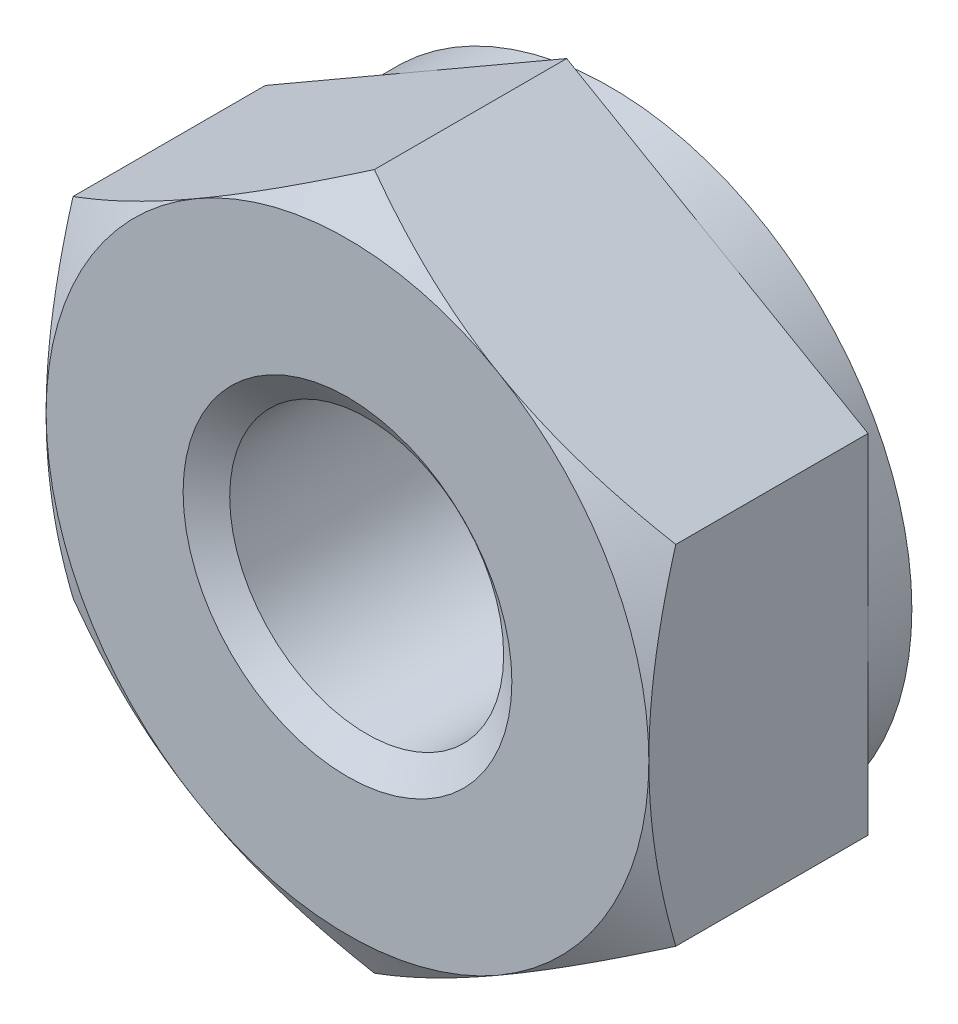
ISO-10303-21;
HEADER;
FILE_DESCRIPTION(('STEP AP214'),'2;1');
FILE_NAME('part.step','',(''),(''),'','','');
FILE_SCHEMA(('AUTOMOTIVE_DESIGN { 1 0 10303 214 1 1 1 1 }'));
ENDSEC;
DATA;
#1=APPLICATION_CONTEXT('core data for automotive mechanical design processes');
#2=APPLICATION_PROTOCOL_DEFINITION('international standard','automotive_design',2000,#1);
#3=PRODUCT_CONTEXT('',#1,'mechanical');
#4=PRODUCT('Part','Part','',(#3));
#5=PRODUCT_RELATED_PRODUCT_CATEGORY('part','',(#4));
#6=PRODUCT_DEFINITION_FORMATION('','',#4);
#7=PRODUCT_DEFINITION_CONTEXT('part definition',#1,'design');
#8=PRODUCT_DEFINITION('design','',#6,#7);
#9=PRODUCT_DEFINITION_SHAPE('','',#8);
#10=(LENGTH_UNIT() NAMED_UNIT(*) SI_UNIT(.MILLI.,.METRE.));
#11=(NAMED_UNIT(*) PLANE_ANGLE_UNIT() SI_UNIT($,.RADIAN.));
#12=(NAMED_UNIT(*) SI_UNIT($,.STERADIAN.) SOLID_ANGLE_UNIT());
#13=UNCERTAINTY_MEASURE_WITH_UNIT(LENGTH_MEASURE(1.E-05),#10,'distance_accuracy_value','');
#14=(GEOMETRIC_REPRESENTATION_CONTEXT(3) GLOBAL_UNCERTAINTY_ASSIGNED_CONTEXT((#13)) GLOBAL_UNIT_ASSIGNED_CONTEXT((#10,
#11,#12)) REPRESENTATION_CONTEXT('',''));
#15=CARTESIAN_POINT('',(0.,0.,0.));
#16=DIRECTION('',(0.,0.,1.));
#17=DIRECTION('',(1.,0.,0.));
#18=AXIS2_PLACEMENT_3D('',#15,#16,#17);
#19=CARTESIAN_POINT('',(0.,0.,-2.4));
#20=DIRECTION('',(0.,0.,1.));
#21=DIRECTION('',(1.,0.,0.));
#22=AXIS2_PLACEMENT_3D('',#19,#20,#21);
#23=CYLINDRICAL_SURFACE('',#22,1.25);
#24=CARTESIAN_POINT('',(0.,0.,-0.175051884552426));
#25=DIRECTION('',(0.,0.,1.));
#26=DIRECTION('',(1.,0.,0.));
#27=AXIS2_PLACEMENT_3D('',#24,#25,#26);
#28=CIRCLE('',#27,1.25);
#29=CARTESIAN_POINT('',(1.25,0.,-0.175051884552426));
#30=VERTEX_POINT('',#29);
#31=EDGE_CURVE('E153',#30,#30,#28,.F.);
#32=ORIENTED_EDGE('',*,*,#31,.F.);
#33=EDGE_LOOP('',(#32));
#34=FACE_BOUND('',#33,.T.);
#35=CARTESIAN_POINT('',(0.,0.,-2.19954811544757));
#36=DIRECTION('',(0.,0.,-1.));
#37=DIRECTION('',(-1.,0.,0.));
#38=AXIS2_PLACEMENT_3D('',#35,#36,#37);
#39=CIRCLE('',#38,1.25);
#40=CARTESIAN_POINT('',(-1.25,0.,-2.19954811544757));
#41=VERTEX_POINT('',#40);
#42=EDGE_CURVE('E41',#41,#41,#39,.F.);
#43=ORIENTED_EDGE('',*,*,#42,.F.);
#44=EDGE_LOOP('',(#43));
#45=FACE_BOUND('',#44,.T.);
#46=ADVANCED_FACE('F36',(#34,#45),#23,.F.);
#47=CARTESIAN_POINT('',(0.,3.17542648054295,-2.4));
#48=DIRECTION('',(0.,0.,-1.));
#49=DIRECTION('',(-1.,0.,0.));
#50=AXIS2_PLACEMENT_3D('',#47,#48,#49);
#51=PLANE('',#50);
#52=CARTESIAN_POINT('',(0.,0.,-2.4));
#53=DIRECTION('',(0.,0.,-1.));
#54=DIRECTION('',(-1.,0.,0.));
#55=AXIS2_PLACEMENT_3D('',#52,#53,#54);
#56=CIRCLE('',#55,2.75);
#57=CARTESIAN_POINT('',(-2.75,0.,-2.4));
#58=VERTEX_POINT('',#57);
#59=EDGE_CURVE('E280',#58,#58,#56,.F.);
#60=ORIENTED_EDGE('',*,*,#59,.F.);
#61=EDGE_LOOP('',(#60));
#62=FACE_BOUND('',#61,.T.);
#63=CARTESIAN_POINT('',(0.,0.,-2.4));
#64=DIRECTION('',(0.,0.,-1.));
#65=DIRECTION('',(-1.,0.,0.));
#66=AXIS2_PLACEMENT_3D('',#63,#64,#65);
#67=CIRCLE('',#66,1.5);
#68=CARTESIAN_POINT('',(-1.5,0.,-2.4));
#69=VERTEX_POINT('',#68);
#70=EDGE_CURVE('E300',#69,#69,#67,.F.);
#71=ORIENTED_EDGE('',*,*,#70,.T.);
#72=EDGE_LOOP('',(#71));
#73=FACE_BOUND('',#72,.T.);
#74=ADVANCED_FACE('F232',(#62,#73),#51,.T.);
#75=CARTESIAN_POINT('',(0.,3.17542648054295,0.));
#76=DIRECTION('',(0.,0.,-1.));
#77=DIRECTION('',(-1.,0.,0.));
#78=AXIS2_PLACEMENT_3D('',#75,#76,#77);
#79=PLANE('',#78);
#80=CARTESIAN_POINT('',(0.,0.,0.));
#81=DIRECTION('',(0.,0.,-1.));
#82=DIRECTION('',(-1.,0.,0.));
#83=AXIS2_PLACEMENT_3D('',#80,#81,#82);
#84=CIRCLE('',#83,2.75);
#85=CARTESIAN_POINT('',(-1.375,2.3815698604072,0.));
#86=VERTEX_POINT('',#85);
#87=CARTESIAN_POINT('',(-2.75,0.,0.));
#88=VERTEX_POINT('',#87);
#89=EDGE_CURVE('E48',#86,#88,#84,.F.);
#90=ORIENTED_EDGE('',*,*,#89,.T.);
#91=CARTESIAN_POINT('',(-1.375,-2.3815698604072,0.));
#92=VERTEX_POINT('',#91);
#93=EDGE_CURVE('E12',#88,#92,#84,.F.);
#94=ORIENTED_EDGE('',*,*,#93,.T.);
#95=CARTESIAN_POINT('',(1.375,-2.3815698604072,0.));
#96=VERTEX_POINT('',#95);
#97=EDGE_CURVE('E46',#92,#96,#84,.F.);
#98=ORIENTED_EDGE('',*,*,#97,.T.);
#99=CARTESIAN_POINT('',(2.75,0.,0.));
#100=VERTEX_POINT('',#99);
#101=EDGE_CURVE('E132',#96,#100,#84,.F.);
#102=ORIENTED_EDGE('',*,*,#101,.T.);
#103=CARTESIAN_POINT('',(0.,0.,0.));
#104=DIRECTION('',(0.,0.,1.));
#105=DIRECTION('',(1.,0.,0.));
#106=AXIS2_PLACEMENT_3D('',#103,#104,#105);
#107=CIRCLE('',#106,2.75);
#108=CARTESIAN_POINT('',(1.375,2.3815698604072,0.));
#109=VERTEX_POINT('',#108);
#110=EDGE_CURVE('E144',#100,#109,#107,.T.);
#111=ORIENTED_EDGE('',*,*,#110,.T.);
#112=EDGE_CURVE('E159',#109,#86,#84,.F.);
#113=ORIENTED_EDGE('',*,*,#112,.T.);
#114=EDGE_LOOP('',(#90,#94,#98,#102,#111,#113));
#115=FACE_BOUND('',#114,.T.);
#116=CARTESIAN_POINT('',(0.,0.,0.));
#117=DIRECTION('',(0.,0.,1.));
#118=DIRECTION('',(1.,0.,0.));
#119=AXIS2_PLACEMENT_3D('',#116,#117,#118);
#120=CIRCLE('',#119,1.5);
#121=CARTESIAN_POINT('',(1.5,0.,0.));
#122=VERTEX_POINT('',#121);
#123=EDGE_CURVE('E299',#122,#122,#120,.T.);
#124=ORIENTED_EDGE('',*,*,#123,.F.);
#125=EDGE_LOOP('',(#124));
#126=FACE_BOUND('',#125,.T.);
#127=ADVANCED_FACE('F156',(#115,#126),#79,.F.);
#128=CARTESIAN_POINT('',(0.,3.17542648054294,-2.4));
#129=DIRECTION('',(-0.500000000000001,0.866025403784438,0.));
#130=DIRECTION('',(-0.866025403784438,-0.500000000000001,0.));
#131=AXIS2_PLACEMENT_3D('',#128,#129,#130);
#132=PLANE('',#131);
#133=DIRECTION('',(0.,0.,1.));
#134=VECTOR('',#133,1.);
#135=CARTESIAN_POINT('',(-2.75,1.58771324027147,-2.4));
#136=LINE('',#135,#134);
#137=CARTESIAN_POINT('',(-2.75,1.58771324027147,-2.));
#138=VERTEX_POINT('',#137);
#139=CARTESIAN_POINT('',(-2.75,1.58771324027147,-0.245620093061865));
#140=VERTEX_POINT('',#139);
#141=EDGE_CURVE('E289',#138,#140,#136,.T.);
#142=ORIENTED_EDGE('',*,*,#141,.T.);
#143=CARTESIAN_POINT('',(-2.7502,1.58759777021763,-0.24568676336476));
#144=CARTESIAN_POINT('',(-2.62935077934009,1.65737010029698,-0.205387662249263));
#145=CARTESIAN_POINT('',(-2.50745839737737,1.72774469983533,-0.168736902597662));
#146=CARTESIAN_POINT('',(-2.26156287327211,1.86971254687003,-0.104762182969801));
#147=CARTESIAN_POINT('',(-2.13755536142614,1.94130831721583,-0.077460855674497));
#148=CARTESIAN_POINT('',(-1.89107720202406,2.08361254889599,-0.0349617452941163));
#149=CARTESIAN_POINT('',(-1.76864448141258,2.15429911309864,-0.0194811186224572));
#150=CARTESIAN_POINT('',(-1.52320285763108,2.29600490065923,-0.000999397369940011));
#151=CARTESIAN_POINT('',(-1.40019484676709,2.36702360884404,0.00201700053740051));
#152=CARTESIAN_POINT('',(-1.17034121338921,2.49972966594897,-0.00425314542854678));
#153=CARTESIAN_POINT('',(-1.06346120874598,2.56143686540073,-0.0120001542767026));
#154=CARTESIAN_POINT('',(-0.850397532665251,2.68444923614047,-0.0365551810643552));
#155=CARTESIAN_POINT('',(-0.744214598351111,2.74575398185008,-0.0533715896505709));
#156=CARTESIAN_POINT('',(-0.530711510606816,2.86902004703207,-0.0954119223459575));
#157=CARTESIAN_POINT('',(-0.423418383857145,2.93096576264319,-0.120814080687232));
#158=CARTESIAN_POINT('',(-0.210432520715949,3.05393320806134,-0.178467225839984));
#159=CARTESIAN_POINT('',(-0.104737054973348,3.11495651365995,-0.210704663298985));
#160=CARTESIAN_POINT('',(0.000199999999999952,3.17554195059678,-0.245686763364763));
#161=B_SPLINE_CURVE_WITH_KNOTS('',3,(#143,#144,#145,#146,#147,#148,#149,#150,#151,#152,#153,
#154,#155,#156,#157,#158,#159,#160),.UNSPECIFIED.,.F.,.F.,(4,2,2,2,2,2,2,2,4),(0.,
0.435912828725889,0.872873557116333,1.29901931904672,1.72464171213574,2.09526089052938,
2.46622354066375,2.84541551798557,3.22386274754525),.UNSPECIFIED.);
#162=EDGE_CURVE('E60',#140,#86,#161,.T.);
#163=ORIENTED_EDGE('',*,*,#162,.T.);
#164=CARTESIAN_POINT('',(0.,3.17542648054295,-0.245620093061865));
#165=VERTEX_POINT('',#164);
#166=EDGE_CURVE('E168',#86,#165,#161,.T.);
#167=ORIENTED_EDGE('',*,*,#166,.T.);
#168=DIRECTION('',(0.,0.,1.));
#169=VECTOR('',#168,1.);
#170=CARTESIAN_POINT('',(0.,3.17542648054294,-2.4));
#171=LINE('',#170,#169);
#172=CARTESIAN_POINT('',(0.,3.17542648054294,-2.));
#173=VERTEX_POINT('',#172);
#174=EDGE_CURVE('E277',#173,#165,#171,.T.);
#175=ORIENTED_EDGE('',*,*,#174,.F.);
#176=DIRECTION('',(-0.866025403784438,-0.500000000000001,0.));
#177=VECTOR('',#176,1.);
#178=CARTESIAN_POINT('',(0.,3.17542648054294,-2.));
#179=LINE('',#178,#177);
#180=CARTESIAN_POINT('',(-1.375,2.38156986040721,-2.));
#181=VERTEX_POINT('',#180);
#182=EDGE_CURVE('E265',#173,#181,#179,.T.);
#183=ORIENTED_EDGE('',*,*,#182,.T.);
#184=EDGE_CURVE('E261',#181,#138,#179,.T.);
#185=ORIENTED_EDGE('',*,*,#184,.T.);
#186=EDGE_LOOP('',(#142,#163,#167,#175,#183,#185));
#187=FACE_BOUND('',#186,.T.);
#188=ADVANCED_FACE('F38',(#187),#132,.T.);
#189=CARTESIAN_POINT('',(2.75,1.58771324027147,-2.4));
#190=DIRECTION('',(0.500000000000001,0.866025403784438,0.));
#191=DIRECTION('',(-0.866025403784438,0.500000000000001,0.));
#192=AXIS2_PLACEMENT_3D('',#189,#190,#191);
#193=PLANE('',#192);
#194=ORIENTED_EDGE('',*,*,#174,.T.);
#195=CARTESIAN_POINT('',(-0.000199999999999979,3.17554195059678,-0.245686763364763));
#196=CARTESIAN_POINT('',(0.120649220659906,3.10576962051743,-0.205387662249265));
#197=CARTESIAN_POINT('',(0.242541602622634,3.03539502097908,-0.168736902597664));
#198=CARTESIAN_POINT('',(0.488437126727893,2.89342717394439,-0.104762182969802));
#199=CARTESIAN_POINT('',(0.612444638573856,2.82183140359859,-0.0774608556744985));
#200=CARTESIAN_POINT('',(0.858922797975944,2.67952717191843,-0.0349617452941174));
#201=CARTESIAN_POINT('',(0.981355518587418,2.60884060771577,-0.019481118622458));
#202=CARTESIAN_POINT('',(1.22679714236892,2.46713482015518,-0.000999397369940287));
#203=CARTESIAN_POINT('',(1.34980515323291,2.39611611197038,0.00201700053740053));
#204=CARTESIAN_POINT('',(1.57965878661079,2.26341005486544,-0.00425314542854643));
#205=CARTESIAN_POINT('',(1.68653879125402,2.20170285541369,-0.0120001542767021));
#206=CARTESIAN_POINT('',(1.89960246733475,2.07869048467395,-0.0365551810643545));
#207=CARTESIAN_POINT('',(2.00578540164889,2.01738573896433,-0.0533715896505701));
#208=CARTESIAN_POINT('',(2.21928848939318,1.89411967378235,-0.095411922345956));
#209=CARTESIAN_POINT('',(2.32658161614286,1.83217395817123,-0.12081408068723));
#210=CARTESIAN_POINT('',(2.53956747928405,1.70920651275307,-0.178467225839982));
#211=CARTESIAN_POINT('',(2.64526294502665,1.64818320715446,-0.210704663298982));
#212=CARTESIAN_POINT('',(2.7502,1.58759777021763,-0.24568676336476));
#213=B_SPLINE_CURVE_WITH_KNOTS('',3,(#195,#196,#197,#198,#199,#200,#201,#202,#203,#204,#205,
#206,#207,#208,#209,#210,#211,#212),.UNSPECIFIED.,.F.,.F.,(4,2,2,2,2,2,2,2,4),(0.,
0.435912828725889,0.872873557116334,1.29901931904672,1.72464171213574,2.09526089052938,
2.46622354066375,2.84541551798558,3.22386274754525),.UNSPECIFIED.);
#214=EDGE_CURVE('E165',#165,#109,#213,.T.);
#215=ORIENTED_EDGE('',*,*,#214,.T.);
#216=CARTESIAN_POINT('',(2.75,1.58771324027148,-0.245620093061865));
#217=VERTEX_POINT('',#216);
#218=EDGE_CURVE('E147',#109,#217,#213,.T.);
#219=ORIENTED_EDGE('',*,*,#218,.T.);
#220=DIRECTION('',(0.,0.,1.));
#221=VECTOR('',#220,1.);
#222=CARTESIAN_POINT('',(2.75,1.58771324027147,-2.4));
#223=LINE('',#222,#221);
#224=CARTESIAN_POINT('',(2.75,1.58771324027147,-2.));
#225=VERTEX_POINT('',#224);
#226=EDGE_CURVE('E164',#225,#217,#223,.T.);
#227=ORIENTED_EDGE('',*,*,#226,.F.);
#228=DIRECTION('',(-0.866025403784438,0.500000000000001,0.));
#229=VECTOR('',#228,1.);
#230=CARTESIAN_POINT('',(2.75,1.58771324027147,-2.));
#231=LINE('',#230,#229);
#232=CARTESIAN_POINT('',(1.375,2.38156986040721,-2.));
#233=VERTEX_POINT('',#232);
#234=EDGE_CURVE('E273',#225,#233,#231,.T.);
#235=ORIENTED_EDGE('',*,*,#234,.T.);
#236=EDGE_CURVE('E269',#233,#173,#231,.T.);
#237=ORIENTED_EDGE('',*,*,#236,.T.);
#238=EDGE_LOOP('',(#194,#215,#219,#227,#235,#237));
#239=FACE_BOUND('',#238,.T.);
#240=ADVANCED_FACE('F245',(#239),#193,.T.);
#241=CARTESIAN_POINT('',(2.75,1.58771324027147,-2.4));
#242=DIRECTION('',(-1.,0.,0.));
#243=DIRECTION('',(0.,0.,1.));
#244=AXIS2_PLACEMENT_3D('',#241,#242,#243);
#245=PLANE('',#244);
#246=CARTESIAN_POINT('',(2.75,-4.21084949309676,-1.31594843960294));
#247=CARTESIAN_POINT('',(2.75,-4.0901089421409,-1.25759993615224));
#248=CARTESIAN_POINT('',(2.75,-3.96908292065509,-1.19983146511759));
#249=CARTESIAN_POINT('',(2.75,-3.72630558284844,-1.08578603842305));
#250=CARTESIAN_POINT('',(2.75,-3.604554145362,-1.02950934100247));
#251=CARTESIAN_POINT('',(2.75,-3.35951393034355,-0.91848244335276));
#252=CARTESIAN_POINT('',(2.75,-3.23622034236437,-0.86374282160584));
#253=CARTESIAN_POINT('',(2.75,-2.98861980138744,-0.756614777476456));
#254=CARTESIAN_POINT('',(2.75,-2.86431290161182,-0.704226232536766));
#255=CARTESIAN_POINT('',(2.75,-2.61294485887172,-0.601803572146126));
#256=CARTESIAN_POINT('',(2.75,-2.48586863815655,-0.551806257898395));
#257=CARTESIAN_POINT('',(2.75,-2.23021732171541,-0.455727408784602));
#258=CARTESIAN_POINT('',(2.75,-2.10164206103363,-0.409646309576973));
#259=CARTESIAN_POINT('',(2.75,-1.84305218799467,-0.322638077046232));
#260=CARTESIAN_POINT('',(2.75,-1.71304130052584,-0.281699986413889));
#261=CARTESIAN_POINT('',(2.75,-1.45117125062148,-0.206307307624349));
#262=CARTESIAN_POINT('',(2.75,-1.31931268690202,-0.171850669152767));
#263=CARTESIAN_POINT('',(2.75,-1.05365722480013,-0.111093671530904));
#264=CARTESIAN_POINT('',(2.75,-0.919859820217593,-0.0847954840951217));
#265=CARTESIAN_POINT('',(2.75,-0.650651874037382,-0.0421260371966113));
#266=CARTESIAN_POINT('',(2.75,-0.515241331013596,-0.0257547865105431));
#267=CARTESIAN_POINT('',(2.75,-0.244373242869211,-0.00438749654023743));
#268=CARTESIAN_POINT('',(2.75,-0.108921526377133,0.00068055677321595));
#269=CARTESIAN_POINT('',(2.75,0.161887058855134,-0.000827795632671998));
#270=CARTESIAN_POINT('',(2.75,0.29724394308964,-0.00740117868555366));
#271=CARTESIAN_POINT('',(2.75,0.528385436717541,-0.0281041300468438));
#272=CARTESIAN_POINT('',(2.75,0.624425050137499,-0.0395376410301882));
#273=CARTESIAN_POINT('',(2.75,0.815762399811542,-0.0675217196133508));
#274=CARTESIAN_POINT('',(2.75,0.911060016631964,-0.0840730942276819));
#275=CARTESIAN_POINT('',(2.75,1.19576218748916,-0.140535361278284));
#276=CARTESIAN_POINT('',(2.75,1.38383224738496,-0.187239859417293));
#277=CARTESIAN_POINT('',(2.75,1.66525048947485,-0.267792497030578));
#278=CARTESIAN_POINT('',(2.75,1.76006556248558,-0.2968033349955));
#279=CARTESIAN_POINT('',(2.75,1.94870609382215,-0.357695648906587));
#280=CARTESIAN_POINT('',(2.75,2.04253218553696,-0.389575144878502));
#281=CARTESIAN_POINT('',(2.75,2.22880240354984,-0.455541418186447));
#282=CARTESIAN_POINT('',(2.75,2.32125133588451,-0.489614761455532));
#283=CARTESIAN_POINT('',(2.75,2.50543192042628,-0.559761368231108));
#284=CARTESIAN_POINT('',(2.75,2.59716326539578,-0.595835440037317));
#285=CARTESIAN_POINT('',(2.75,2.68856293053345,-0.632712441997483));
#286=B_SPLINE_CURVE_WITH_KNOTS('',3,(#246,#247,#248,#249,#250,#251,#252,#253,#254,#255,#256,
#257,#258,#259,#260,#261,#262,#263,#264,#265,#266,#267,#268,#269,#270,#271,#272,#273,#274,#275,
#276,#277,#278,#279,#280,#281,#282,#283,#284,#285),.UNSPECIFIED.,.F.,.F.,(4,2,2,2,2,2,2,2,2,2,2,
2,2,2,2,2,2,2,2,4),(0.,0.402305607365936,0.804680408536997,1.20935783819118,1.61401414820818,
2.0236383818577,2.43330812457349,2.842089694796,3.25074173456636,3.65950246109144,
4.06826354901184,4.4744128402465,4.88045669141172,5.17046846817546,5.46052599902452,
6.04107275309883,6.33851131304661,6.63574613017455,6.93130791005792,7.22698998004822),.UNSPECIFIED.);
#287=CARTESIAN_POINT('',(2.75,-1.58771324027147,-0.245620093061865));
#288=VERTEX_POINT('',#287);
#289=EDGE_CURVE('E128',#288,#100,#286,.T.);
#290=ORIENTED_EDGE('',*,*,#289,.F.);
#291=DIRECTION('',(0.,0.,1.));
#292=VECTOR('',#291,1.);
#293=CARTESIAN_POINT('',(2.75,-1.58771324027148,-2.4));
#294=LINE('',#293,#292);
#295=CARTESIAN_POINT('',(2.75,-1.58771324027148,-2.));
#296=VERTEX_POINT('',#295);
#297=EDGE_CURVE('E282',#296,#288,#294,.T.);
#298=ORIENTED_EDGE('',*,*,#297,.F.);
#299=DIRECTION('',(0.,-1.,0.));
#300=VECTOR('',#299,1.);
#301=CARTESIAN_POINT('',(2.75,1.58771324027147,-2.));
#302=LINE('',#301,#300);
#303=CARTESIAN_POINT('',(2.75,0.,-2.));
#304=VERTEX_POINT('',#303);
#305=EDGE_CURVE('E274',#304,#296,#302,.T.);
#306=ORIENTED_EDGE('',*,*,#305,.F.);
#307=EDGE_CURVE('E276',#225,#304,#302,.T.);
#308=ORIENTED_EDGE('',*,*,#307,.F.);
#309=ORIENTED_EDGE('',*,*,#226,.T.);
#310=EDGE_CURVE('E141',#100,#217,#286,.T.);
#311=ORIENTED_EDGE('',*,*,#310,.F.);
#312=EDGE_LOOP('',(#290,#298,#306,#308,#309,#311));
#313=FACE_BOUND('',#312,.T.);
#314=ADVANCED_FACE('F161',(#313),#245,.F.);
#315=CARTESIAN_POINT('',(0.,-3.17542648054295,-2.4));
#316=DIRECTION('',(0.500000000000001,-0.866025403784438,0.));
#317=DIRECTION('',(0.866025403784438,0.500000000000001,0.));
#318=AXIS2_PLACEMENT_3D('',#315,#316,#317);
#319=PLANE('',#318);
#320=ORIENTED_EDGE('',*,*,#297,.T.);
#321=CARTESIAN_POINT('',(2.7502,-1.58759777021764,-0.245686763364762));
#322=CARTESIAN_POINT('',(2.62935077934009,-1.65737010029699,-0.205387662249265));
#323=CARTESIAN_POINT('',(2.50745839737737,-1.72774469983534,-0.168736902597664));
#324=CARTESIAN_POINT('',(2.26156287327211,-1.86971254687003,-0.104762182969803));
#325=CARTESIAN_POINT('',(2.13755536142614,-1.94130831721583,-0.0774608556744994));
#326=CARTESIAN_POINT('',(1.89107720202406,-2.08361254889599,-0.0349617452941191));
#327=CARTESIAN_POINT('',(1.76864448141258,-2.15429911309865,-0.0194811186224602));
#328=CARTESIAN_POINT('',(1.52320285763108,-2.29600490065924,-0.000999397369943106));
#329=CARTESIAN_POINT('',(1.40019484676709,-2.36702360884404,0.00201700053739756));
#330=CARTESIAN_POINT('',(1.17034121338921,-2.49972966594898,-0.00425314542854994));
#331=CARTESIAN_POINT('',(1.06346120874598,-2.56143686540073,-0.012000154276706));
#332=CARTESIAN_POINT('',(0.850397532665249,-2.68444923614047,-0.036555181064359));
#333=CARTESIAN_POINT('',(0.74421459835111,-2.74575398185009,-0.0533715896505746));
#334=CARTESIAN_POINT('',(0.530711510606816,-2.86902004703207,-0.0954119223459611));
#335=CARTESIAN_POINT('',(0.423418383857144,-2.93096576264319,-0.120814080687236));
#336=CARTESIAN_POINT('',(0.210432520715949,-3.05393320806135,-0.178467225839987));
#337=CARTESIAN_POINT('',(0.104737054973347,-3.11495651365996,-0.210704663298988));
#338=CARTESIAN_POINT('',(-0.000200000000000004,-3.17554195059679,-0.245686763364766));
#339=B_SPLINE_CURVE_WITH_KNOTS('',3,(#321,#322,#323,#324,#325,#326,#327,#328,#329,#330,#331,
#332,#333,#334,#335,#336,#337,#338),.UNSPECIFIED.,.F.,.F.,(4,2,2,2,2,2,2,2,4),(0.,
0.435912828725889,0.872873557116334,1.29901931904672,1.72464171213574,2.09526089052938,
2.46622354066375,2.84541551798557,3.22386274754524),.UNSPECIFIED.);
#340=EDGE_CURVE('E135',#288,#96,#339,.T.);
#341=ORIENTED_EDGE('',*,*,#340,.T.);
#342=CARTESIAN_POINT('',(0.,-3.17542648054294,-0.245620093061865));
#343=VERTEX_POINT('',#342);
#344=EDGE_CURVE('E175',#96,#343,#339,.T.);
#345=ORIENTED_EDGE('',*,*,#344,.T.);
#346=DIRECTION('',(0.,0.,1.));
#347=VECTOR('',#346,1.);
#348=CARTESIAN_POINT('',(0.,-3.17542648054295,-2.4));
#349=LINE('',#348,#347);
#350=CARTESIAN_POINT('',(0.,-3.17542648054295,-2.));
#351=VERTEX_POINT('',#350);
#352=EDGE_CURVE('E284',#351,#343,#349,.T.);
#353=ORIENTED_EDGE('',*,*,#352,.F.);
#354=DIRECTION('',(0.866025403784438,0.500000000000001,0.));
#355=VECTOR('',#354,1.);
#356=CARTESIAN_POINT('',(0.,-3.17542648054295,-2.));
#357=LINE('',#356,#355);
#358=CARTESIAN_POINT('',(1.37500000000001,-2.38156986040721,-2.));
#359=VERTEX_POINT('',#358);
#360=EDGE_CURVE('E266',#351,#359,#357,.T.);
#361=ORIENTED_EDGE('',*,*,#360,.T.);
#362=EDGE_CURVE('E270',#359,#296,#357,.T.);
#363=ORIENTED_EDGE('',*,*,#362,.T.);
#364=EDGE_LOOP('',(#320,#341,#345,#353,#361,#363));
#365=FACE_BOUND('',#364,.T.);
#366=ADVANCED_FACE('F218',(#365),#319,.T.);
#367=CARTESIAN_POINT('',(-2.75,-1.58771324027148,-2.4));
#368=DIRECTION('',(-0.500000000000001,-0.866025403784438,0.));
#369=DIRECTION('',(0.866025403784438,-0.500000000000001,0.));
#370=AXIS2_PLACEMENT_3D('',#367,#368,#369);
#371=PLANE('',#370);
#372=ORIENTED_EDGE('',*,*,#352,.T.);
#373=CARTESIAN_POINT('',(0.000199999999999937,-3.17554195059679,-0.245686763364766));
#374=CARTESIAN_POINT('',(-0.120649220659906,-3.10576962051743,-0.205387662249269));
#375=CARTESIAN_POINT('',(-0.242541602622634,-3.03539502097909,-0.168736902597667));
#376=CARTESIAN_POINT('',(-0.488437126727894,-2.89342717394439,-0.104762182969805));
#377=CARTESIAN_POINT('',(-0.612444638573857,-2.82183140359859,-0.0774608556745013));
#378=CARTESIAN_POINT('',(-0.858922797975946,-2.67952717191843,-0.0349617452941203));
#379=CARTESIAN_POINT('',(-0.98135551858742,-2.60884060771578,-0.0194811186224612));
#380=CARTESIAN_POINT('',(-1.22679714236892,-2.46713482015519,-0.000999397369943545));
#381=CARTESIAN_POINT('',(-1.34980515323292,-2.39611611197038,0.00201700053739738));
#382=CARTESIAN_POINT('',(-1.5796587866108,-2.26341005486545,-0.00425314542854941));
#383=CARTESIAN_POINT('',(-1.68653879125402,-2.20170285541369,-0.012000154276705));
#384=CARTESIAN_POINT('',(-1.89960246733475,-2.07869048467395,-0.0365551810643573));
#385=CARTESIAN_POINT('',(-2.00578540164889,-2.01738573896434,-0.0533715896505729));
#386=CARTESIAN_POINT('',(-2.21928848939319,-1.89411967378235,-0.0954119223459589));
#387=CARTESIAN_POINT('',(-2.32658161614286,-1.83217395817123,-0.120814080687233));
#388=CARTESIAN_POINT('',(-2.53956747928405,-1.70920651275308,-0.178467225839984));
#389=CARTESIAN_POINT('',(-2.64526294502665,-1.64818320715447,-0.210704663298984));
#390=CARTESIAN_POINT('',(-2.7502,-1.58759777021764,-0.245686763364762));
#391=B_SPLINE_CURVE_WITH_KNOTS('',3,(#373,#374,#375,#376,#377,#378,#379,#380,#381,#382,#383,
#384,#385,#386,#387,#388,#389,#390),.UNSPECIFIED.,.F.,.F.,(4,2,2,2,2,2,2,2,4),(0.,
0.43591282872589,0.872873557116336,1.29901931904672,1.72464171213574,2.09526089052938,
2.46622354066375,2.84541551798557,3.22386274754525),.UNSPECIFIED.);
#392=EDGE_CURVE('E212',#343,#92,#391,.T.);
#393=ORIENTED_EDGE('',*,*,#392,.T.);
#394=CARTESIAN_POINT('',(-2.75,-1.58771324027148,-0.245620093061865));
#395=VERTEX_POINT('',#394);
#396=EDGE_CURVE('E205',#92,#395,#391,.T.);
#397=ORIENTED_EDGE('',*,*,#396,.T.);
#398=DIRECTION('',(0.,0.,1.));
#399=VECTOR('',#398,1.);
#400=CARTESIAN_POINT('',(-2.75,-1.58771324027148,-2.4));
#401=LINE('',#400,#399);
#402=CARTESIAN_POINT('',(-2.75,-1.58771324027148,-2.));
#403=VERTEX_POINT('',#402);
#404=EDGE_CURVE('E287',#403,#395,#401,.T.);
#405=ORIENTED_EDGE('',*,*,#404,.F.);
#406=DIRECTION('',(0.866025403784438,-0.500000000000001,0.));
#407=VECTOR('',#406,1.);
#408=CARTESIAN_POINT('',(-2.75,-1.58771324027148,-2.));
#409=LINE('',#408,#407);
#410=CARTESIAN_POINT('',(-1.37500000000001,-2.38156986040721,-2.));
#411=VERTEX_POINT('',#410);
#412=EDGE_CURVE('E256',#403,#411,#409,.T.);
#413=ORIENTED_EDGE('',*,*,#412,.T.);
#414=EDGE_CURVE('E262',#411,#351,#409,.T.);
#415=ORIENTED_EDGE('',*,*,#414,.T.);
#416=EDGE_LOOP('',(#372,#393,#397,#405,#413,#415));
#417=FACE_BOUND('',#416,.T.);
#418=ADVANCED_FACE('F214',(#417),#371,.T.);
#419=CARTESIAN_POINT('',(-2.75,1.58771324027147,-2.4));
#420=DIRECTION('',(-1.,0.,0.));
#421=DIRECTION('',(0.,0.,1.));
#422=AXIS2_PLACEMENT_3D('',#419,#420,#421);
#423=PLANE('',#422);
#424=ORIENTED_EDGE('',*,*,#404,.T.);
#425=CARTESIAN_POINT('',(-2.75,-4.21084949309676,-1.31594843960294));
#426=CARTESIAN_POINT('',(-2.75,-4.0901089421409,-1.25759993615224));
#427=CARTESIAN_POINT('',(-2.75,-3.96908292065509,-1.19983146511759));
#428=CARTESIAN_POINT('',(-2.75,-3.72630558284844,-1.08578603842305));
#429=CARTESIAN_POINT('',(-2.75,-3.604554145362,-1.02950934100247));
#430=CARTESIAN_POINT('',(-2.75,-3.35951393034355,-0.91848244335276));
#431=CARTESIAN_POINT('',(-2.75,-3.23622034236437,-0.86374282160584));
#432=CARTESIAN_POINT('',(-2.75,-2.98861980138744,-0.756614777476456));
#433=CARTESIAN_POINT('',(-2.75,-2.86431290161182,-0.704226232536766));
#434=CARTESIAN_POINT('',(-2.75,-2.61294485887172,-0.601803572146126));
#435=CARTESIAN_POINT('',(-2.75,-2.48586863815655,-0.551806257898395));
#436=CARTESIAN_POINT('',(-2.75,-2.23021732171541,-0.455727408784602));
#437=CARTESIAN_POINT('',(-2.75,-2.10164206103363,-0.409646309576973));
#438=CARTESIAN_POINT('',(-2.75,-1.84305218799467,-0.322638077046232));
#439=CARTESIAN_POINT('',(-2.75,-1.71304130052583,-0.281699986413889));
#440=CARTESIAN_POINT('',(-2.75,-1.45117125062148,-0.206307307624349));
#441=CARTESIAN_POINT('',(-2.75,-1.31931268690202,-0.171850669152767));
#442=CARTESIAN_POINT('',(-2.75,-1.05365722480013,-0.111093671530904));
#443=CARTESIAN_POINT('',(-2.75,-0.919859820217592,-0.0847954840951217));
#444=CARTESIAN_POINT('',(-2.75,-0.650651874037382,-0.0421260371966113));
#445=CARTESIAN_POINT('',(-2.75,-0.515241331013595,-0.0257547865105431));
#446=CARTESIAN_POINT('',(-2.75,-0.244373242869211,-0.00438749654023743));
#447=CARTESIAN_POINT('',(-2.75,-0.108921526377133,0.00068055677321595));
#448=CARTESIAN_POINT('',(-2.75,0.161887058855134,-0.000827795632671998));
#449=CARTESIAN_POINT('',(-2.75,0.29724394308964,-0.00740117868555365));
#450=CARTESIAN_POINT('',(-2.75,0.528385436717541,-0.0281041300468438));
#451=CARTESIAN_POINT('',(-2.75,0.624425050137499,-0.0395376410301882));
#452=CARTESIAN_POINT('',(-2.75,0.815762399811542,-0.0675217196133508));
#453=CARTESIAN_POINT('',(-2.75,0.911060016631964,-0.0840730942276819));
#454=CARTESIAN_POINT('',(-2.75,1.19576218748916,-0.140535361278284));
#455=CARTESIAN_POINT('',(-2.75,1.38383224738496,-0.187239859417293));
#456=CARTESIAN_POINT('',(-2.75,1.66525048947485,-0.267792497030578));
#457=CARTESIAN_POINT('',(-2.75,1.76006556248558,-0.2968033349955));
#458=CARTESIAN_POINT('',(-2.75,1.94870609382215,-0.357695648906587));
#459=CARTESIAN_POINT('',(-2.75,2.04253218553696,-0.389575144878503));
#460=CARTESIAN_POINT('',(-2.75,2.22880240354984,-0.455541418186448));
#461=CARTESIAN_POINT('',(-2.75,2.32125133588451,-0.489614761455532));
#462=CARTESIAN_POINT('',(-2.75,2.50543192042628,-0.559761368231108));
#463=CARTESIAN_POINT('',(-2.75,2.59716326539579,-0.595835440037317));
#464=CARTESIAN_POINT('',(-2.75,2.68856293053345,-0.632712441997483));
#465=B_SPLINE_CURVE_WITH_KNOTS('',3,(#425,#426,#427,#428,#429,#430,#431,#432,#433,#434,#435,
#436,#437,#438,#439,#440,#441,#442,#443,#444,#445,#446,#447,#448,#449,#450,#451,#452,#453,#454,
#455,#456,#457,#458,#459,#460,#461,#462,#463,#464),.UNSPECIFIED.,.F.,.F.,(4,2,2,2,2,2,2,2,2,2,2,
2,2,2,2,2,2,2,2,4),(0.,0.402305607365936,0.804680408536997,1.20935783819118,1.61401414820818,
2.0236383818577,2.43330812457349,2.842089694796,3.25074173456636,3.65950246109144,
4.06826354901184,4.4744128402465,4.88045669141172,5.17046846817546,5.46052599902452,
6.04107275309883,6.33851131304661,6.63574613017455,6.93130791005792,7.22698998004822),.UNSPECIFIED.);
#466=EDGE_CURVE('E213',#395,#88,#465,.T.);
#467=ORIENTED_EDGE('',*,*,#466,.T.);
#468=EDGE_CURVE('E152',#88,#140,#465,.T.);
#469=ORIENTED_EDGE('',*,*,#468,.T.);
#470=ORIENTED_EDGE('',*,*,#141,.F.);
#471=DIRECTION('',(0.,-1.,0.));
#472=VECTOR('',#471,1.);
#473=CARTESIAN_POINT('',(-2.75,1.58771324027147,-2.));
#474=LINE('',#473,#472);
#475=CARTESIAN_POINT('',(-2.75,0.,-2.));
#476=VERTEX_POINT('',#475);
#477=EDGE_CURVE('E296',#138,#476,#474,.T.);
#478=ORIENTED_EDGE('',*,*,#477,.T.);
#479=EDGE_CURVE('E294',#476,#403,#474,.T.);
#480=ORIENTED_EDGE('',*,*,#479,.T.);
#481=EDGE_LOOP('',(#424,#467,#469,#470,#478,#480));
#482=FACE_BOUND('',#481,.T.);
#483=ADVANCED_FACE('F217',(#482),#423,.T.);
#484=CARTESIAN_POINT('',(0.,13.1754264805429,-2.));
#485=DIRECTION('',(0.,0.,-1.));
#486=DIRECTION('',(-1.,0.,0.));
#487=AXIS2_PLACEMENT_3D('',#484,#485,#486);
#488=PLANE('',#487);
#489=ORIENTED_EDGE('',*,*,#307,.T.);
#490=CARTESIAN_POINT('',(0.,0.,-2.));
#491=DIRECTION('',(0.,0.,1.));
#492=DIRECTION('',(1.,0.,0.));
#493=AXIS2_PLACEMENT_3D('',#490,#491,#492);
#494=CIRCLE('',#493,2.75);
#495=EDGE_CURVE('E253',#304,#233,#494,.T.);
#496=ORIENTED_EDGE('',*,*,#495,.T.);
#497=ORIENTED_EDGE('',*,*,#234,.F.);
#498=EDGE_LOOP('',(#489,#496,#497));
#499=FACE_BOUND('',#498,.T.);
#500=ADVANCED_FACE('F223',(#499),#488,.T.);
#501=ORIENTED_EDGE('',*,*,#305,.T.);
#502=ORIENTED_EDGE('',*,*,#362,.F.);
#503=EDGE_CURVE('E258',#359,#304,#494,.T.);
#504=ORIENTED_EDGE('',*,*,#503,.T.);
#505=EDGE_LOOP('',(#501,#502,#504));
#506=FACE_BOUND('',#505,.T.);
#507=ADVANCED_FACE('F228',(#506),#488,.T.);
#508=EDGE_CURVE('E257',#233,#181,#494,.T.);
#509=ORIENTED_EDGE('',*,*,#508,.T.);
#510=ORIENTED_EDGE('',*,*,#182,.F.);
#511=ORIENTED_EDGE('',*,*,#236,.F.);
#512=EDGE_LOOP('',(#509,#510,#511));
#513=FACE_BOUND('',#512,.T.);
#514=ADVANCED_FACE('F437',(#513),#488,.T.);
#515=ORIENTED_EDGE('',*,*,#414,.F.);
#516=EDGE_CURVE('E509',#411,#359,#494,.T.);
#517=ORIENTED_EDGE('',*,*,#516,.T.);
#518=ORIENTED_EDGE('',*,*,#360,.F.);
#519=EDGE_LOOP('',(#515,#517,#518));
#520=FACE_BOUND('',#519,.T.);
#521=ADVANCED_FACE('F428',(#520),#488,.T.);
#522=EDGE_CURVE('E526',#181,#476,#494,.T.);
#523=ORIENTED_EDGE('',*,*,#522,.T.);
#524=ORIENTED_EDGE('',*,*,#477,.F.);
#525=ORIENTED_EDGE('',*,*,#184,.F.);
#526=EDGE_LOOP('',(#523,#524,#525));
#527=FACE_BOUND('',#526,.T.);
#528=ADVANCED_FACE('F412',(#527),#488,.T.);
#529=CARTESIAN_POINT('',(0.,0.,0.));
#530=DIRECTION('',(0.,0.,1.));
#531=DIRECTION('',(1.,0.,0.));
#532=AXIS2_PLACEMENT_3D('',#529,#530,#531);
#533=CYLINDRICAL_SURFACE('',#532,2.75);
#534=ORIENTED_EDGE('',*,*,#59,.T.);
#535=EDGE_LOOP('',(#534));
#536=FACE_BOUND('',#535,.T.);
#537=ORIENTED_EDGE('',*,*,#508,.F.);
#538=ORIENTED_EDGE('',*,*,#495,.F.);
#539=ORIENTED_EDGE('',*,*,#503,.F.);
#540=ORIENTED_EDGE('',*,*,#516,.F.);
#541=EDGE_CURVE('E521',#476,#411,#494,.T.);
#542=ORIENTED_EDGE('',*,*,#541,.F.);
#543=ORIENTED_EDGE('',*,*,#522,.F.);
#544=EDGE_LOOP('',(#537,#538,#539,#540,#542,#543));
#545=FACE_BOUND('',#544,.T.);
#546=ADVANCED_FACE('F242',(#536,#545),#533,.T.);
#547=ORIENTED_EDGE('',*,*,#479,.F.);
#548=ORIENTED_EDGE('',*,*,#541,.T.);
#549=ORIENTED_EDGE('',*,*,#412,.F.);
#550=EDGE_LOOP('',(#547,#548,#549));
#551=FACE_BOUND('',#550,.T.);
#552=ADVANCED_FACE('F195',(#551),#488,.T.);
#553=CARTESIAN_POINT('',(0.,0.,0.));
#554=DIRECTION('',(0.,0.,-1.));
#555=DIRECTION('',(-1.,0.,0.));
#556=AXIS2_PLACEMENT_3D('',#553,#554,#555);
#557=CONICAL_SURFACE('',#556,2.75,1.0471975511966);
#558=ORIENTED_EDGE('',*,*,#468,.F.);
#559=ORIENTED_EDGE('',*,*,#89,.F.);
#560=ORIENTED_EDGE('',*,*,#162,.F.);
#561=EDGE_LOOP('',(#558,#559,#560));
#562=FACE_BOUND('',#561,.T.);
#563=ADVANCED_FACE('F374',(#562),#557,.T.);
#564=ORIENTED_EDGE('',*,*,#112,.F.);
#565=ORIENTED_EDGE('',*,*,#214,.F.);
#566=ORIENTED_EDGE('',*,*,#166,.F.);
#567=EDGE_LOOP('',(#564,#565,#566));
#568=FACE_BOUND('',#567,.T.);
#569=ADVANCED_FACE('F193',(#568),#557,.T.);
#570=ORIENTED_EDGE('',*,*,#110,.F.);
#571=ORIENTED_EDGE('',*,*,#310,.T.);
#572=ORIENTED_EDGE('',*,*,#218,.F.);
#573=EDGE_LOOP('',(#570,#571,#572));
#574=FACE_BOUND('',#573,.T.);
#575=ADVANCED_FACE('F145',(#574),#557,.T.);
#576=ORIENTED_EDGE('',*,*,#289,.T.);
#577=ORIENTED_EDGE('',*,*,#101,.F.);
#578=ORIENTED_EDGE('',*,*,#340,.F.);
#579=EDGE_LOOP('',(#576,#577,#578));
#580=FACE_BOUND('',#579,.T.);
#581=ADVANCED_FACE('F130',(#580),#557,.T.);
#582=ORIENTED_EDGE('',*,*,#97,.F.);
#583=ORIENTED_EDGE('',*,*,#392,.F.);
#584=ORIENTED_EDGE('',*,*,#344,.F.);
#585=EDGE_LOOP('',(#582,#583,#584));
#586=FACE_BOUND('',#585,.T.);
#587=ADVANCED_FACE('F192',(#586),#557,.T.);
#588=ORIENTED_EDGE('',*,*,#93,.F.);
#589=ORIENTED_EDGE('',*,*,#466,.F.);
#590=ORIENTED_EDGE('',*,*,#396,.F.);
#591=EDGE_LOOP('',(#588,#589,#590));
#592=FACE_BOUND('',#591,.T.);
#593=ADVANCED_FACE('F186',(#592),#557,.T.);
#594=CARTESIAN_POINT('',(0.,0.,-0.192557073007669));
#595=DIRECTION('',(0.,0.,1.));
#596=DIRECTION('',(1.,0.,0.));
#597=AXIS2_PLACEMENT_3D('',#594,#595,#596);
#598=CONICAL_SURFACE('',#597,1.225,0.959931088596885);
#599=ORIENTED_EDGE('',*,*,#123,.T.);
#600=EDGE_LOOP('',(#599));
#601=FACE_BOUND('',#600,.T.);
#602=ORIENTED_EDGE('',*,*,#31,.T.);
#603=EDGE_LOOP('',(#602));
#604=FACE_BOUND('',#603,.T.);
#605=ADVANCED_FACE('F191',(#601,#604),#598,.F.);
#606=CARTESIAN_POINT('',(0.,0.,-2.3746));
#607=DIRECTION('',(0.,0.,-1.));
#608=DIRECTION('',(-1.,0.,0.));
#609=AXIS2_PLACEMENT_3D('',#606,#607,#608);
#610=CONICAL_SURFACE('',#609,1.5,0.959931088596877);
#611=CARTESIAN_POINT('',(0.,0.,-2.3746));
#612=DIRECTION('',(0.,0.,1.));
#613=DIRECTION('',(1.,0.,0.));
#614=AXIS2_PLACEMENT_3D('',#611,#612,#613);
#615=CIRCLE('',#614,1.5);
#616=CARTESIAN_POINT('',(1.5,0.,-2.3746));
#617=VERTEX_POINT('',#616);
#618=EDGE_CURVE('E302',#617,#617,#615,.T.);
#619=ORIENTED_EDGE('',*,*,#618,.F.);
#620=EDGE_LOOP('',(#619));
#621=FACE_BOUND('',#620,.T.);
#622=ORIENTED_EDGE('',*,*,#42,.T.);
#623=EDGE_LOOP('',(#622));
#624=FACE_BOUND('',#623,.T.);
#625=ADVANCED_FACE('F316',(#621,#624),#610,.F.);
#626=CARTESIAN_POINT('',(0.,0.,-25.0375057290932));
#627=DIRECTION('',(0.,0.,1.));
#628=DIRECTION('',(1.,0.,0.));
#629=AXIS2_PLACEMENT_3D('',#626,#627,#628);
#630=CYLINDRICAL_SURFACE('',#629,1.5);
#631=ORIENTED_EDGE('',*,*,#70,.F.);
#632=EDGE_LOOP('',(#631));
#633=FACE_BOUND('',#632,.T.);
#634=ORIENTED_EDGE('',*,*,#618,.T.);
#635=EDGE_LOOP('',(#634));
#636=FACE_BOUND('',#635,.T.);
#637=ADVANCED_FACE('F320',(#633,#636),#630,.F.);
#638=CLOSED_SHELL('',(#46,#74,#127,#188,#240,#314,#366,#418,#483,#500,#507,#514,#521,#528,#546,
#552,#563,#569,#575,#581,#587,#593,#605,#625,#637));
#639=MANIFOLD_SOLID_BREP('B2',#638);
#640=ADVANCED_BREP_SHAPE_REPRESENTATION('',(#18,#639),#14);
#641=SHAPE_DEFINITION_REPRESENTATION(#9,#640);
ENDSEC;
END-ISO-10303-21;
